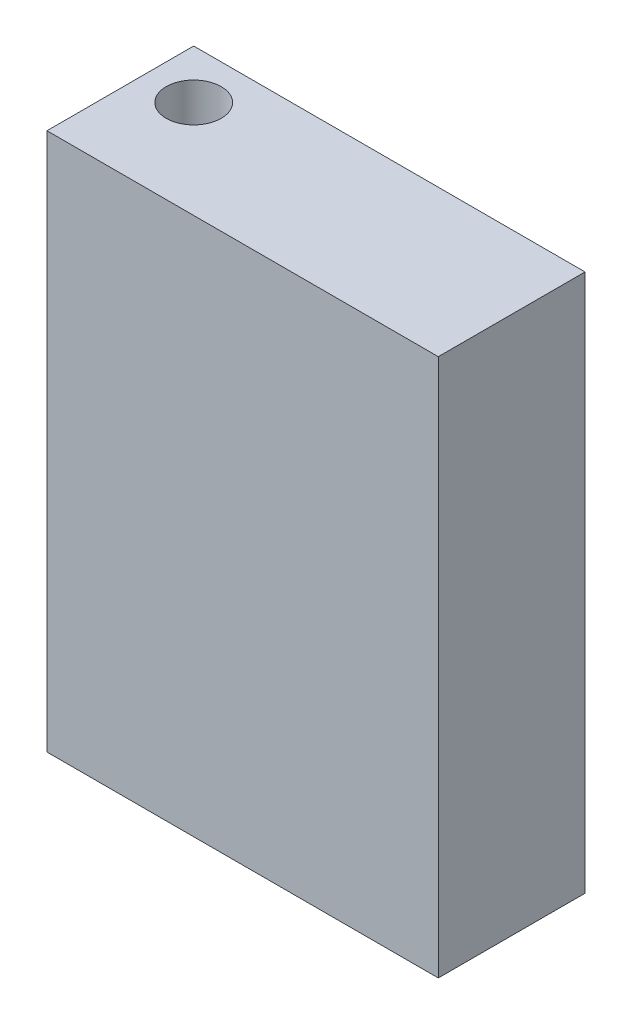
ISO-10303-21;
HEADER;
FILE_DESCRIPTION(('STEP AP214'),'2;1');
FILE_NAME('part.step','',(''),(''),'','','');
FILE_SCHEMA(('AUTOMOTIVE_DESIGN { 1 0 10303 214 1 1 1 1 }'));
ENDSEC;
DATA;
#1=APPLICATION_CONTEXT('core data for automotive mechanical design processes');
#2=APPLICATION_PROTOCOL_DEFINITION('international standard','automotive_design',2000,#1);
#3=PRODUCT_CONTEXT('',#1,'mechanical');
#4=PRODUCT('Part','Part','',(#3));
#5=PRODUCT_RELATED_PRODUCT_CATEGORY('part','',(#4));
#6=PRODUCT_DEFINITION_FORMATION('','',#4);
#7=PRODUCT_DEFINITION_CONTEXT('part definition',#1,'design');
#8=PRODUCT_DEFINITION('design','',#6,#7);
#9=PRODUCT_DEFINITION_SHAPE('','',#8);
#10=(LENGTH_UNIT() NAMED_UNIT(*) SI_UNIT(.MILLI.,.METRE.));
#11=(NAMED_UNIT(*) PLANE_ANGLE_UNIT() SI_UNIT($,.RADIAN.));
#12=(NAMED_UNIT(*) SI_UNIT($,.STERADIAN.) SOLID_ANGLE_UNIT());
#13=UNCERTAINTY_MEASURE_WITH_UNIT(LENGTH_MEASURE(1.E-05),#10,'distance_accuracy_value','');
#14=(GEOMETRIC_REPRESENTATION_CONTEXT(3) GLOBAL_UNCERTAINTY_ASSIGNED_CONTEXT((#13)) GLOBAL_UNIT_ASSIGNED_CONTEXT((#10,
#11,#12)) REPRESENTATION_CONTEXT('',''));
#15=CARTESIAN_POINT('',(0.,0.,0.));
#16=DIRECTION('',(0.,0.,1.));
#17=DIRECTION('',(1.,0.,0.));
#18=AXIS2_PLACEMENT_3D('',#15,#16,#17);
#19=CARTESIAN_POINT('',(0.,0.,19.05));
#20=DIRECTION('',(1.,0.,0.));
#21=DIRECTION('',(0.,0.,-1.));
#22=AXIS2_PLACEMENT_3D('',#19,#20,#21);
#23=PLANE('',#22);
#24=DIRECTION('',(0.,-1.,0.));
#25=VECTOR('',#24,1.);
#26=CARTESIAN_POINT('',(0.,0.,0.));
#27=LINE('',#26,#25);
#28=CARTESIAN_POINT('',(0.,69.85,0.));
#29=VERTEX_POINT('',#28);
#30=CARTESIAN_POINT('',(0.,0.,0.));
#31=VERTEX_POINT('',#30);
#32=EDGE_CURVE('E96',#29,#31,#27,.T.);
#33=ORIENTED_EDGE('',*,*,#32,.T.);
#34=DIRECTION('',(0.,0.,-1.));
#35=VECTOR('',#34,1.);
#36=CARTESIAN_POINT('',(0.,0.,19.05));
#37=LINE('',#36,#35);
#38=CARTESIAN_POINT('',(0.,0.,19.05));
#39=VERTEX_POINT('',#38);
#40=EDGE_CURVE('E11',#39,#31,#37,.T.);
#41=ORIENTED_EDGE('',*,*,#40,.F.);
#42=DIRECTION('',(0.,-1.,0.));
#43=VECTOR('',#42,1.);
#44=CARTESIAN_POINT('',(0.,0.,19.05));
#45=LINE('',#44,#43);
#46=CARTESIAN_POINT('',(0.,69.85,19.05));
#47=VERTEX_POINT('',#46);
#48=EDGE_CURVE('E84',#47,#39,#45,.T.);
#49=ORIENTED_EDGE('',*,*,#48,.F.);
#50=DIRECTION('',(0.,0.,-1.));
#51=VECTOR('',#50,1.);
#52=CARTESIAN_POINT('',(0.,69.85,19.05));
#53=LINE('',#52,#51);
#54=EDGE_CURVE('E92',#47,#29,#53,.T.);
#55=ORIENTED_EDGE('',*,*,#54,.T.);
#56=EDGE_LOOP('',(#33,#41,#49,#55));
#57=FACE_BOUND('',#56,.T.);
#58=ADVANCED_FACE('F33',(#57),#23,.F.);
#59=CARTESIAN_POINT('',(0.,0.,19.05));
#60=DIRECTION('',(0.,1.,0.));
#61=DIRECTION('',(0.,0.,1.));
#62=AXIS2_PLACEMENT_3D('',#59,#60,#61);
#63=PLANE('',#62);
#64=CARTESIAN_POINT('',(6.35,0.,6.35));
#65=DIRECTION('',(0.,1.,0.));
#66=DIRECTION('',(0.,0.,1.));
#67=AXIS2_PLACEMENT_3D('',#64,#65,#66);
#68=CIRCLE('',#67,3.571875);
#69=CARTESIAN_POINT('',(6.35,0.,9.921875));
#70=VERTEX_POINT('',#69);
#71=EDGE_CURVE('E99',#70,#70,#68,.T.);
#72=ORIENTED_EDGE('',*,*,#71,.T.);
#73=EDGE_LOOP('',(#72));
#74=FACE_BOUND('',#73,.T.);
#75=DIRECTION('',(1.,0.,0.));
#76=VECTOR('',#75,1.);
#77=CARTESIAN_POINT('',(0.,0.,0.));
#78=LINE('',#77,#76);
#79=CARTESIAN_POINT('',(50.8,0.,0.));
#80=VERTEX_POINT('',#79);
#81=EDGE_CURVE('E88',#31,#80,#78,.T.);
#82=ORIENTED_EDGE('',*,*,#81,.T.);
#83=DIRECTION('',(0.,0.,-1.));
#84=VECTOR('',#83,1.);
#85=CARTESIAN_POINT('',(50.8,0.,19.05));
#86=LINE('',#85,#84);
#87=CARTESIAN_POINT('',(50.8,0.,19.05));
#88=VERTEX_POINT('',#87);
#89=EDGE_CURVE('E41',#88,#80,#86,.T.);
#90=ORIENTED_EDGE('',*,*,#89,.F.);
#91=DIRECTION('',(1.,0.,0.));
#92=VECTOR('',#91,1.);
#93=CARTESIAN_POINT('',(0.,0.,19.05));
#94=LINE('',#93,#92);
#95=EDGE_CURVE('E79',#39,#88,#94,.T.);
#96=ORIENTED_EDGE('',*,*,#95,.F.);
#97=ORIENTED_EDGE('',*,*,#40,.T.);
#98=EDGE_LOOP('',(#82,#90,#96,#97));
#99=FACE_BOUND('',#98,.T.);
#100=ADVANCED_FACE('F87',(#74,#99),#63,.F.);
#101=CARTESIAN_POINT('',(50.8,0.,19.05));
#102=DIRECTION('',(-1.,0.,0.));
#103=DIRECTION('',(0.,0.,1.));
#104=AXIS2_PLACEMENT_3D('',#101,#102,#103);
#105=PLANE('',#104);
#106=DIRECTION('',(0.,1.,0.));
#107=VECTOR('',#106,1.);
#108=CARTESIAN_POINT('',(50.8,0.,0.));
#109=LINE('',#108,#107);
#110=CARTESIAN_POINT('',(50.8,69.85,0.));
#111=VERTEX_POINT('',#110);
#112=EDGE_CURVE('E66',#80,#111,#109,.T.);
#113=ORIENTED_EDGE('',*,*,#112,.T.);
#114=DIRECTION('',(0.,0.,-1.));
#115=VECTOR('',#114,1.);
#116=CARTESIAN_POINT('',(50.8,69.85,19.05));
#117=LINE('',#116,#115);
#118=CARTESIAN_POINT('',(50.8,69.85,19.05));
#119=VERTEX_POINT('',#118);
#120=EDGE_CURVE('E89',#119,#111,#117,.T.);
#121=ORIENTED_EDGE('',*,*,#120,.F.);
#122=DIRECTION('',(0.,1.,0.));
#123=VECTOR('',#122,1.);
#124=CARTESIAN_POINT('',(50.8,0.,19.05));
#125=LINE('',#124,#123);
#126=EDGE_CURVE('E82',#88,#119,#125,.T.);
#127=ORIENTED_EDGE('',*,*,#126,.F.);
#128=ORIENTED_EDGE('',*,*,#89,.T.);
#129=EDGE_LOOP('',(#113,#121,#127,#128));
#130=FACE_BOUND('',#129,.T.);
#131=ADVANCED_FACE('F90',(#130),#105,.F.);
#132=CARTESIAN_POINT('',(0.,69.85,19.05));
#133=DIRECTION('',(0.,-1.,0.));
#134=DIRECTION('',(0.,0.,-1.));
#135=AXIS2_PLACEMENT_3D('',#132,#133,#134);
#136=PLANE('',#135);
#137=CARTESIAN_POINT('',(6.35,69.85,6.35));
#138=DIRECTION('',(0.,1.,0.));
#139=DIRECTION('',(0.,0.,1.));
#140=AXIS2_PLACEMENT_3D('',#137,#138,#139);
#141=CIRCLE('',#140,3.571875);
#142=CARTESIAN_POINT('',(6.35,69.85,9.921875));
#143=VERTEX_POINT('',#142);
#144=EDGE_CURVE('E110',#143,#143,#141,.T.);
#145=ORIENTED_EDGE('',*,*,#144,.F.);
#146=EDGE_LOOP('',(#145));
#147=FACE_BOUND('',#146,.T.);
#148=DIRECTION('',(-1.,0.,0.));
#149=VECTOR('',#148,1.);
#150=CARTESIAN_POINT('',(0.,69.85,0.));
#151=LINE('',#150,#149);
#152=EDGE_CURVE('E72',#111,#29,#151,.T.);
#153=ORIENTED_EDGE('',*,*,#152,.T.);
#154=ORIENTED_EDGE('',*,*,#54,.F.);
#155=DIRECTION('',(-1.,0.,0.));
#156=VECTOR('',#155,1.);
#157=CARTESIAN_POINT('',(0.,69.85,19.05));
#158=LINE('',#157,#156);
#159=EDGE_CURVE('E49',#119,#47,#158,.T.);
#160=ORIENTED_EDGE('',*,*,#159,.F.);
#161=ORIENTED_EDGE('',*,*,#120,.T.);
#162=EDGE_LOOP('',(#153,#154,#160,#161));
#163=FACE_BOUND('',#162,.T.);
#164=ADVANCED_FACE('F104',(#147,#163),#136,.F.);
#165=CARTESIAN_POINT('',(0.,0.,19.05));
#166=DIRECTION('',(0.,0.,-1.));
#167=DIRECTION('',(-1.,0.,0.));
#168=AXIS2_PLACEMENT_3D('',#165,#166,#167);
#169=PLANE('',#168);
#170=ORIENTED_EDGE('',*,*,#48,.T.);
#171=ORIENTED_EDGE('',*,*,#95,.T.);
#172=ORIENTED_EDGE('',*,*,#126,.T.);
#173=ORIENTED_EDGE('',*,*,#159,.T.);
#174=EDGE_LOOP('',(#170,#171,#172,#173));
#175=FACE_BOUND('',#174,.T.);
#176=ADVANCED_FACE('F80',(#175),#169,.F.);
#177=CARTESIAN_POINT('',(0.,0.,0.));
#178=DIRECTION('',(0.,0.,-1.));
#179=DIRECTION('',(-1.,0.,0.));
#180=AXIS2_PLACEMENT_3D('',#177,#178,#179);
#181=PLANE('',#180);
#182=ORIENTED_EDGE('',*,*,#32,.F.);
#183=ORIENTED_EDGE('',*,*,#152,.F.);
#184=ORIENTED_EDGE('',*,*,#112,.F.);
#185=ORIENTED_EDGE('',*,*,#81,.F.);
#186=EDGE_LOOP('',(#182,#183,#184,#185));
#187=FACE_BOUND('',#186,.T.);
#188=ADVANCED_FACE('F107',(#187),#181,.T.);
#189=CARTESIAN_POINT('',(6.35,0.,6.35));
#190=DIRECTION('',(0.,1.,0.));
#191=DIRECTION('',(0.,0.,1.));
#192=AXIS2_PLACEMENT_3D('',#189,#190,#191);
#193=CYLINDRICAL_SURFACE('',#192,3.571875);
#194=ORIENTED_EDGE('',*,*,#71,.F.);
#195=EDGE_LOOP('',(#194));
#196=FACE_BOUND('',#195,.T.);
#197=ORIENTED_EDGE('',*,*,#144,.T.);
#198=EDGE_LOOP('',(#197));
#199=FACE_BOUND('',#198,.T.);
#200=ADVANCED_FACE('F117',(#196,#199),#193,.F.);
#201=CLOSED_SHELL('',(#58,#100,#131,#164,#176,#188,#200));
#202=MANIFOLD_SOLID_BREP('B2',#201);
#203=ADVANCED_BREP_SHAPE_REPRESENTATION('',(#18,#202),#14);
#204=SHAPE_DEFINITION_REPRESENTATION(#9,#203);
ENDSEC;
END-ISO-10303-21;
